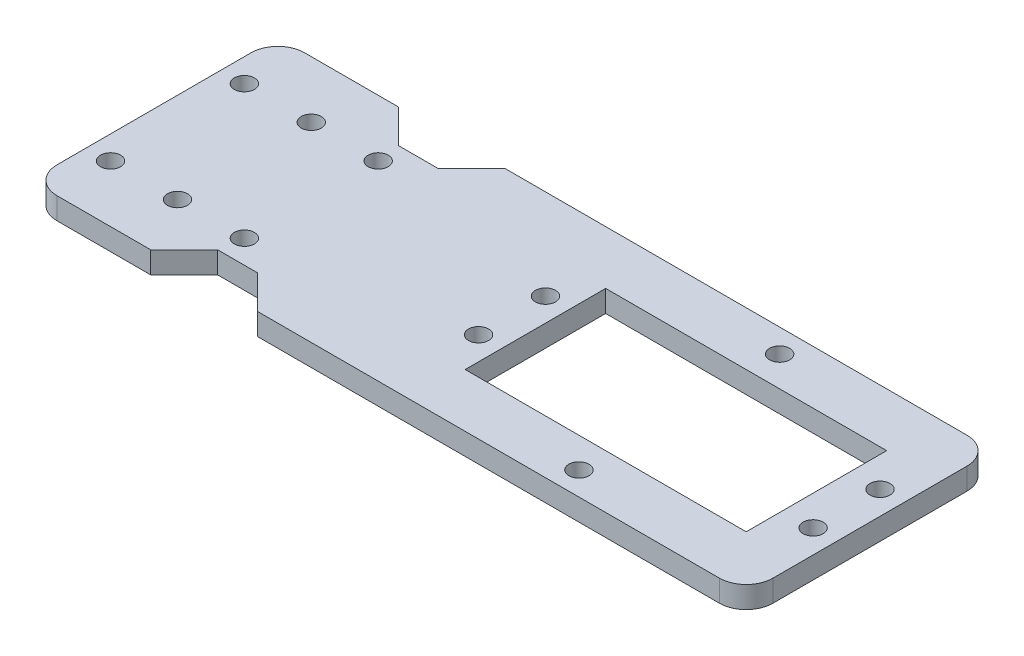
ISO-10303-21;
HEADER;
FILE_DESCRIPTION(('STEP AP214'),'2;1');
FILE_NAME('part.step','',(''),(''),'','','');
FILE_SCHEMA(('AUTOMOTIVE_DESIGN { 1 0 10303 214 1 1 1 1 }'));
ENDSEC;
DATA;
#1=APPLICATION_CONTEXT('core data for automotive mechanical design processes');
#2=APPLICATION_PROTOCOL_DEFINITION('international standard','automotive_design',2000,#1);
#3=PRODUCT_CONTEXT('',#1,'mechanical');
#4=PRODUCT('Part','Part','',(#3));
#5=PRODUCT_RELATED_PRODUCT_CATEGORY('part','',(#4));
#6=PRODUCT_DEFINITION_FORMATION('','',#4);
#7=PRODUCT_DEFINITION_CONTEXT('part definition',#1,'design');
#8=PRODUCT_DEFINITION('design','',#6,#7);
#9=PRODUCT_DEFINITION_SHAPE('','',#8);
#10=(LENGTH_UNIT() NAMED_UNIT(*) SI_UNIT(.MILLI.,.METRE.));
#11=(NAMED_UNIT(*) PLANE_ANGLE_UNIT() SI_UNIT($,.RADIAN.));
#12=(NAMED_UNIT(*) SI_UNIT($,.STERADIAN.) SOLID_ANGLE_UNIT());
#13=UNCERTAINTY_MEASURE_WITH_UNIT(LENGTH_MEASURE(1.E-05),#10,'distance_accuracy_value','');
#14=(GEOMETRIC_REPRESENTATION_CONTEXT(3) GLOBAL_UNCERTAINTY_ASSIGNED_CONTEXT((#13)) GLOBAL_UNIT_ASSIGNED_CONTEXT((#10,
#11,#12)) REPRESENTATION_CONTEXT('',''));
#15=CARTESIAN_POINT('',(0.,0.,0.));
#16=DIRECTION('',(0.,0.,1.));
#17=DIRECTION('',(1.,0.,0.));
#18=AXIS2_PLACEMENT_3D('',#15,#16,#17);
#19=CARTESIAN_POINT('',(0.,3.25,10.5000000000001));
#20=DIRECTION('',(0.,0.,-1.));
#21=DIRECTION('',(-1.,0.,0.));
#22=AXIS2_PLACEMENT_3D('',#19,#20,#21);
#23=PLANE('',#22);
#24=DIRECTION('',(1.,0.,0.));
#25=VECTOR('',#24,1.);
#26=CARTESIAN_POINT('',(0.,0.,10.5000000000001));
#27=LINE('',#26,#25);
#28=CARTESIAN_POINT('',(3.50000000000001,0.,10.5000000000001));
#29=VERTEX_POINT('',#28);
#30=CARTESIAN_POINT('',(45.5,0.,10.4999999999999));
#31=VERTEX_POINT('',#30);
#32=EDGE_CURVE('E289',#29,#31,#27,.T.);
#33=ORIENTED_EDGE('',*,*,#32,.F.);
#34=DIRECTION('',(0.,-1.,0.));
#35=VECTOR('',#34,1.);
#36=CARTESIAN_POINT('',(3.50000000000001,3.25,10.5000000000001));
#37=LINE('',#36,#35);
#38=CARTESIAN_POINT('',(3.50000000000001,3.25,10.5000000000001));
#39=VERTEX_POINT('',#38);
#40=EDGE_CURVE('E11',#39,#29,#37,.T.);
#41=ORIENTED_EDGE('',*,*,#40,.F.);
#42=DIRECTION('',(1.,0.,0.));
#43=VECTOR('',#42,1.);
#44=CARTESIAN_POINT('',(0.,3.25,10.5000000000001));
#45=LINE('',#44,#43);
#46=CARTESIAN_POINT('',(45.5,3.25,10.4999999999999));
#47=VERTEX_POINT('',#46);
#48=EDGE_CURVE('E196',#39,#47,#45,.T.);
#49=ORIENTED_EDGE('',*,*,#48,.T.);
#50=DIRECTION('',(0.,-1.,0.));
#51=VECTOR('',#50,1.);
#52=CARTESIAN_POINT('',(45.5,3.25,10.4999999999999));
#53=LINE('',#52,#51);
#54=EDGE_CURVE('E56',#47,#31,#53,.T.);
#55=ORIENTED_EDGE('',*,*,#54,.T.);
#56=EDGE_LOOP('',(#33,#41,#49,#55));
#57=FACE_BOUND('',#56,.T.);
#58=ADVANCED_FACE('F37',(#57),#23,.T.);
#59=CARTESIAN_POINT('',(3.5,3.25,0.));
#60=DIRECTION('',(1.,0.,0.));
#61=DIRECTION('',(0.,0.,-1.));
#62=AXIS2_PLACEMENT_3D('',#59,#60,#61);
#63=PLANE('',#62);
#64=DIRECTION('',(0.,0.,1.));
#65=VECTOR('',#64,1.);
#66=CARTESIAN_POINT('',(3.5,0.,0.));
#67=LINE('',#66,#65);
#68=CARTESIAN_POINT('',(3.5,0.,-10.4999999999999));
#69=VERTEX_POINT('',#68);
#70=EDGE_CURVE('E185',#69,#29,#67,.T.);
#71=ORIENTED_EDGE('',*,*,#70,.F.);
#72=DIRECTION('',(0.,-1.,0.));
#73=VECTOR('',#72,1.);
#74=CARTESIAN_POINT('',(3.5,3.25,-10.4999999999999));
#75=LINE('',#74,#73);
#76=CARTESIAN_POINT('',(3.5,3.25,-10.4999999999999));
#77=VERTEX_POINT('',#76);
#78=EDGE_CURVE('E47',#77,#69,#75,.T.);
#79=ORIENTED_EDGE('',*,*,#78,.F.);
#80=DIRECTION('',(0.,0.,1.));
#81=VECTOR('',#80,1.);
#82=CARTESIAN_POINT('',(3.5,3.25,0.));
#83=LINE('',#82,#81);
#84=EDGE_CURVE('E183',#77,#39,#83,.T.);
#85=ORIENTED_EDGE('',*,*,#84,.T.);
#86=ORIENTED_EDGE('',*,*,#40,.T.);
#87=EDGE_LOOP('',(#71,#79,#85,#86));
#88=FACE_BOUND('',#87,.T.);
#89=ADVANCED_FACE('F182',(#88),#63,.T.);
#90=CARTESIAN_POINT('',(0.,3.25,-10.4999999999999));
#91=DIRECTION('',(0.,0.,1.));
#92=DIRECTION('',(1.,0.,0.));
#93=AXIS2_PLACEMENT_3D('',#90,#91,#92);
#94=PLANE('',#93);
#95=DIRECTION('',(-1.,0.,0.));
#96=VECTOR('',#95,1.);
#97=CARTESIAN_POINT('',(0.,0.,-10.4999999999999));
#98=LINE('',#97,#96);
#99=CARTESIAN_POINT('',(45.5,0.,-10.5000000000001));
#100=VERTEX_POINT('',#99);
#101=EDGE_CURVE('E292',#100,#69,#98,.T.);
#102=ORIENTED_EDGE('',*,*,#101,.F.);
#103=DIRECTION('',(0.,-1.,0.));
#104=VECTOR('',#103,1.);
#105=CARTESIAN_POINT('',(45.5,3.25,-10.5000000000001));
#106=LINE('',#105,#104);
#107=CARTESIAN_POINT('',(45.5,3.25,-10.5000000000001));
#108=VERTEX_POINT('',#107);
#109=EDGE_CURVE('E117',#108,#100,#106,.T.);
#110=ORIENTED_EDGE('',*,*,#109,.F.);
#111=DIRECTION('',(-1.,0.,0.));
#112=VECTOR('',#111,1.);
#113=CARTESIAN_POINT('',(0.,3.25,-10.4999999999999));
#114=LINE('',#113,#112);
#115=EDGE_CURVE('E195',#108,#77,#114,.T.);
#116=ORIENTED_EDGE('',*,*,#115,.T.);
#117=ORIENTED_EDGE('',*,*,#78,.T.);
#118=EDGE_LOOP('',(#102,#110,#116,#117));
#119=FACE_BOUND('',#118,.T.);
#120=ADVANCED_FACE('F198',(#119),#94,.T.);
#121=CARTESIAN_POINT('',(49.5,3.25,-14.5));
#122=DIRECTION('',(0.,-1.,0.));
#123=DIRECTION('',(0.,0.,-1.));
#124=AXIS2_PLACEMENT_3D('',#121,#122,#123);
#125=CYLINDRICAL_SURFACE('',#124,4.);
#126=CARTESIAN_POINT('',(49.5,0.,-14.5));
#127=DIRECTION('',(0.,1.,0.));
#128=DIRECTION('',(0.,0.,1.));
#129=AXIS2_PLACEMENT_3D('',#126,#127,#128);
#130=CIRCLE('',#129,4.);
#131=CARTESIAN_POINT('',(49.5,0.,-18.5));
#132=VERTEX_POINT('',#131);
#133=CARTESIAN_POINT('',(53.5,0.,-14.5));
#134=VERTEX_POINT('',#133);
#135=EDGE_CURVE('E241',#132,#134,#130,.F.);
#136=ORIENTED_EDGE('',*,*,#135,.F.);
#137=DIRECTION('',(0.,-1.,0.));
#138=VECTOR('',#137,1.);
#139=CARTESIAN_POINT('',(49.5,3.25,-18.5));
#140=LINE('',#139,#138);
#141=CARTESIAN_POINT('',(49.5,3.25,-18.5));
#142=VERTEX_POINT('',#141);
#143=EDGE_CURVE('E41',#142,#132,#140,.T.);
#144=ORIENTED_EDGE('',*,*,#143,.F.);
#145=CARTESIAN_POINT('',(49.5,3.25,-14.5));
#146=DIRECTION('',(0.,1.,0.));
#147=DIRECTION('',(0.,0.,1.));
#148=AXIS2_PLACEMENT_3D('',#145,#146,#147);
#149=CIRCLE('',#148,4.);
#150=CARTESIAN_POINT('',(53.5,3.25,-14.5));
#151=VERTEX_POINT('',#150);
#152=EDGE_CURVE('E786',#142,#151,#149,.F.);
#153=ORIENTED_EDGE('',*,*,#152,.T.);
#154=DIRECTION('',(0.,-1.,0.));
#155=VECTOR('',#154,1.);
#156=CARTESIAN_POINT('',(53.5,3.25,-14.5));
#157=LINE('',#156,#155);
#158=EDGE_CURVE('E201',#151,#134,#157,.T.);
#159=ORIENTED_EDGE('',*,*,#158,.T.);
#160=EDGE_LOOP('',(#136,#144,#153,#159));
#161=FACE_BOUND('',#160,.T.);
#162=ADVANCED_FACE('F340',(#161),#125,.T.);
#163=CARTESIAN_POINT('',(0.,3.25,-18.5));
#164=DIRECTION('',(0.,0.,-1.));
#165=DIRECTION('',(-1.,0.,0.));
#166=AXIS2_PLACEMENT_3D('',#163,#164,#165);
#167=PLANE('',#166);
#168=DIRECTION('',(1.,0.,0.));
#169=VECTOR('',#168,1.);
#170=CARTESIAN_POINT('',(0.,0.,-18.5));
#171=LINE('',#170,#169);
#172=CARTESIAN_POINT('',(-19.5,0.,-18.5));
#173=VERTEX_POINT('',#172);
#174=EDGE_CURVE('E244',#173,#132,#171,.T.);
#175=ORIENTED_EDGE('',*,*,#174,.F.);
#176=DIRECTION('',(0.,-1.,0.));
#177=VECTOR('',#176,1.);
#178=CARTESIAN_POINT('',(-19.5,3.25,-18.5));
#179=LINE('',#178,#177);
#180=CARTESIAN_POINT('',(-19.5,3.25,-18.5));
#181=VERTEX_POINT('',#180);
#182=EDGE_CURVE('E330',#181,#173,#179,.T.);
#183=ORIENTED_EDGE('',*,*,#182,.F.);
#184=DIRECTION('',(1.,0.,0.));
#185=VECTOR('',#184,1.);
#186=CARTESIAN_POINT('',(0.,3.25,-18.5));
#187=LINE('',#186,#185);
#188=EDGE_CURVE('E339',#181,#142,#187,.T.);
#189=ORIENTED_EDGE('',*,*,#188,.T.);
#190=ORIENTED_EDGE('',*,*,#143,.T.);
#191=EDGE_LOOP('',(#175,#183,#189,#190));
#192=FACE_BOUND('',#191,.T.);
#193=ADVANCED_FACE('F337',(#192),#167,.T.);
#194=CARTESIAN_POINT('',(-19.,3.25,-19.));
#195=DIRECTION('',(-0.707106781186547,0.,-0.707106781186548));
#196=DIRECTION('',(-0.707106781186548,0.,0.707106781186547));
#197=AXIS2_PLACEMENT_3D('',#194,#195,#196);
#198=PLANE('',#197);
#199=DIRECTION('',(0.707106781186548,0.,-0.707106781186547));
#200=VECTOR('',#199,1.);
#201=CARTESIAN_POINT('',(-19.,0.,-19.));
#202=LINE('',#201,#200);
#203=CARTESIAN_POINT('',(-24.5,0.,-13.5));
#204=VERTEX_POINT('',#203);
#205=EDGE_CURVE('E247',#204,#173,#202,.T.);
#206=ORIENTED_EDGE('',*,*,#205,.F.);
#207=DIRECTION('',(0.,-1.,0.));
#208=VECTOR('',#207,1.);
#209=CARTESIAN_POINT('',(-24.5,3.25,-13.5));
#210=LINE('',#209,#208);
#211=CARTESIAN_POINT('',(-24.5,3.25,-13.5));
#212=VERTEX_POINT('',#211);
#213=EDGE_CURVE('E329',#212,#204,#210,.T.);
#214=ORIENTED_EDGE('',*,*,#213,.F.);
#215=DIRECTION('',(0.707106781186548,0.,-0.707106781186547));
#216=VECTOR('',#215,1.);
#217=CARTESIAN_POINT('',(-19.,3.25,-19.));
#218=LINE('',#217,#216);
#219=EDGE_CURVE('E348',#212,#181,#218,.T.);
#220=ORIENTED_EDGE('',*,*,#219,.T.);
#221=ORIENTED_EDGE('',*,*,#182,.T.);
#222=EDGE_LOOP('',(#206,#214,#220,#221));
#223=FACE_BOUND('',#222,.T.);
#224=ADVANCED_FACE('F346',(#223),#198,.T.);
#225=CARTESIAN_POINT('',(0.,3.25,-13.5));
#226=DIRECTION('',(0.,0.,-1.));
#227=DIRECTION('',(-1.,0.,0.));
#228=AXIS2_PLACEMENT_3D('',#225,#226,#227);
#229=PLANE('',#228);
#230=DIRECTION('',(1.,0.,0.));
#231=VECTOR('',#230,1.);
#232=CARTESIAN_POINT('',(0.,0.,-13.5));
#233=LINE('',#232,#231);
#234=CARTESIAN_POINT('',(-30.5,0.,-13.5));
#235=VERTEX_POINT('',#234);
#236=EDGE_CURVE('E250',#235,#204,#233,.T.);
#237=ORIENTED_EDGE('',*,*,#236,.F.);
#238=DIRECTION('',(0.,-1.,0.));
#239=VECTOR('',#238,1.);
#240=CARTESIAN_POINT('',(-30.5,3.25,-13.5));
#241=LINE('',#240,#239);
#242=CARTESIAN_POINT('',(-30.5,3.25,-13.5));
#243=VERTEX_POINT('',#242);
#244=EDGE_CURVE('E327',#243,#235,#241,.T.);
#245=ORIENTED_EDGE('',*,*,#244,.F.);
#246=DIRECTION('',(1.,0.,0.));
#247=VECTOR('',#246,1.);
#248=CARTESIAN_POINT('',(0.,3.25,-13.5));
#249=LINE('',#248,#247);
#250=EDGE_CURVE('E354',#243,#212,#249,.T.);
#251=ORIENTED_EDGE('',*,*,#250,.T.);
#252=ORIENTED_EDGE('',*,*,#213,.T.);
#253=EDGE_LOOP('',(#237,#245,#251,#252));
#254=FACE_BOUND('',#253,.T.);
#255=ADVANCED_FACE('F357',(#254),#229,.T.);
#256=CARTESIAN_POINT('',(-8.49999999999999,3.25,8.49999999999999));
#257=DIRECTION('',(0.707106781186547,0.,-0.707106781186548));
#258=DIRECTION('',(-0.707106781186548,0.,-0.707106781186547));
#259=AXIS2_PLACEMENT_3D('',#256,#257,#258);
#260=PLANE('',#259);
#261=DIRECTION('',(0.707106781186548,0.,0.707106781186547));
#262=VECTOR('',#261,1.);
#263=CARTESIAN_POINT('',(-8.49999999999999,0.,8.49999999999999));
#264=LINE('',#263,#262);
#265=CARTESIAN_POINT('',(-35.5,0.,-18.5));
#266=VERTEX_POINT('',#265);
#267=EDGE_CURVE('E253',#266,#235,#264,.T.);
#268=ORIENTED_EDGE('',*,*,#267,.F.);
#269=DIRECTION('',(0.,-1.,0.));
#270=VECTOR('',#269,1.);
#271=CARTESIAN_POINT('',(-35.5,3.25,-18.5));
#272=LINE('',#271,#270);
#273=CARTESIAN_POINT('',(-35.5,3.25,-18.5));
#274=VERTEX_POINT('',#273);
#275=EDGE_CURVE('E325',#274,#266,#272,.T.);
#276=ORIENTED_EDGE('',*,*,#275,.F.);
#277=DIRECTION('',(0.707106781186548,0.,0.707106781186547));
#278=VECTOR('',#277,1.);
#279=CARTESIAN_POINT('',(-8.49999999999999,3.25,8.49999999999999));
#280=LINE('',#279,#278);
#281=EDGE_CURVE('E358',#274,#243,#280,.T.);
#282=ORIENTED_EDGE('',*,*,#281,.T.);
#283=ORIENTED_EDGE('',*,*,#244,.T.);
#284=EDGE_LOOP('',(#268,#276,#282,#283));
#285=FACE_BOUND('',#284,.T.);
#286=ADVANCED_FACE('F457',(#285),#260,.T.);
#287=CARTESIAN_POINT('',(0.,3.25,-18.5));
#288=DIRECTION('',(0.,0.,-1.));
#289=DIRECTION('',(-1.,0.,0.));
#290=AXIS2_PLACEMENT_3D('',#287,#288,#289);
#291=PLANE('',#290);
#292=DIRECTION('',(1.,0.,0.));
#293=VECTOR('',#292,1.);
#294=CARTESIAN_POINT('',(0.,0.,-18.5));
#295=LINE('',#294,#293);
#296=CARTESIAN_POINT('',(-49.5,0.,-18.5));
#297=VERTEX_POINT('',#296);
#298=EDGE_CURVE('E256',#297,#266,#295,.T.);
#299=ORIENTED_EDGE('',*,*,#298,.F.);
#300=DIRECTION('',(0.,-1.,0.));
#301=VECTOR('',#300,1.);
#302=CARTESIAN_POINT('',(-49.5,3.25,-18.5));
#303=LINE('',#302,#301);
#304=CARTESIAN_POINT('',(-49.5,3.25,-18.5));
#305=VERTEX_POINT('',#304);
#306=EDGE_CURVE('E323',#305,#297,#303,.T.);
#307=ORIENTED_EDGE('',*,*,#306,.F.);
#308=DIRECTION('',(1.,0.,0.));
#309=VECTOR('',#308,1.);
#310=CARTESIAN_POINT('',(0.,3.25,-18.5));
#311=LINE('',#310,#309);
#312=EDGE_CURVE('E360',#305,#274,#311,.T.);
#313=ORIENTED_EDGE('',*,*,#312,.T.);
#314=ORIENTED_EDGE('',*,*,#275,.T.);
#315=EDGE_LOOP('',(#299,#307,#313,#314));
#316=FACE_BOUND('',#315,.T.);
#317=ADVANCED_FACE('F453',(#316),#291,.T.);
#318=CARTESIAN_POINT('',(-49.5,3.25,-14.5));
#319=DIRECTION('',(0.,-1.,0.));
#320=DIRECTION('',(0.,0.,-1.));
#321=AXIS2_PLACEMENT_3D('',#318,#319,#320);
#322=CYLINDRICAL_SURFACE('',#321,4.);
#323=CARTESIAN_POINT('',(-49.5,0.,-14.5));
#324=DIRECTION('',(0.,1.,0.));
#325=DIRECTION('',(0.,0.,1.));
#326=AXIS2_PLACEMENT_3D('',#323,#324,#325);
#327=CIRCLE('',#326,4.);
#328=CARTESIAN_POINT('',(-53.5,0.,-14.5));
#329=VERTEX_POINT('',#328);
#330=EDGE_CURVE('E259',#297,#329,#327,.T.);
#331=ORIENTED_EDGE('',*,*,#330,.T.);
#332=DIRECTION('',(0.,-1.,0.));
#333=VECTOR('',#332,1.);
#334=CARTESIAN_POINT('',(-53.5,3.25,-14.5));
#335=LINE('',#334,#333);
#336=CARTESIAN_POINT('',(-53.5,3.25,-14.5));
#337=VERTEX_POINT('',#336);
#338=EDGE_CURVE('E320',#337,#329,#335,.T.);
#339=ORIENTED_EDGE('',*,*,#338,.F.);
#340=CARTESIAN_POINT('',(-49.5,3.25,-14.5));
#341=DIRECTION('',(0.,1.,0.));
#342=DIRECTION('',(0.,0.,1.));
#343=AXIS2_PLACEMENT_3D('',#340,#341,#342);
#344=CIRCLE('',#343,4.);
#345=EDGE_CURVE('E366',#305,#337,#344,.T.);
#346=ORIENTED_EDGE('',*,*,#345,.F.);
#347=ORIENTED_EDGE('',*,*,#306,.T.);
#348=EDGE_LOOP('',(#331,#339,#346,#347));
#349=FACE_BOUND('',#348,.T.);
#350=ADVANCED_FACE('F449',(#349),#322,.T.);
#351=CARTESIAN_POINT('',(-53.5,3.25,0.));
#352=DIRECTION('',(1.,0.,0.));
#353=DIRECTION('',(0.,0.,-1.));
#354=AXIS2_PLACEMENT_3D('',#351,#352,#353);
#355=PLANE('',#354);
#356=DIRECTION('',(0.,0.,1.));
#357=VECTOR('',#356,1.);
#358=CARTESIAN_POINT('',(-53.5,0.,0.));
#359=LINE('',#358,#357);
#360=CARTESIAN_POINT('',(-53.5,0.,14.5));
#361=VERTEX_POINT('',#360);
#362=EDGE_CURVE('E262',#329,#361,#359,.T.);
#363=ORIENTED_EDGE('',*,*,#362,.T.);
#364=DIRECTION('',(0.,-1.,0.));
#365=VECTOR('',#364,1.);
#366=CARTESIAN_POINT('',(-53.5,3.25,14.5));
#367=LINE('',#366,#365);
#368=CARTESIAN_POINT('',(-53.5,3.25,14.5));
#369=VERTEX_POINT('',#368);
#370=EDGE_CURVE('E317',#369,#361,#367,.T.);
#371=ORIENTED_EDGE('',*,*,#370,.F.);
#372=DIRECTION('',(0.,0.,1.));
#373=VECTOR('',#372,1.);
#374=CARTESIAN_POINT('',(-53.5,3.25,0.));
#375=LINE('',#374,#373);
#376=EDGE_CURVE('E369',#337,#369,#375,.T.);
#377=ORIENTED_EDGE('',*,*,#376,.F.);
#378=ORIENTED_EDGE('',*,*,#338,.T.);
#379=EDGE_LOOP('',(#363,#371,#377,#378));
#380=FACE_BOUND('',#379,.T.);
#381=ADVANCED_FACE('F445',(#380),#355,.F.);
#382=CARTESIAN_POINT('',(-49.5,3.25,14.5));
#383=DIRECTION('',(0.,-1.,0.));
#384=DIRECTION('',(0.,0.,-1.));
#385=AXIS2_PLACEMENT_3D('',#382,#383,#384);
#386=CYLINDRICAL_SURFACE('',#385,4.);
#387=CARTESIAN_POINT('',(-49.5,0.,14.5));
#388=DIRECTION('',(0.,1.,0.));
#389=DIRECTION('',(0.,0.,1.));
#390=AXIS2_PLACEMENT_3D('',#387,#388,#389);
#391=CIRCLE('',#390,4.);
#392=CARTESIAN_POINT('',(-49.5,0.,18.5));
#393=VERTEX_POINT('',#392);
#394=EDGE_CURVE('E265',#361,#393,#391,.T.);
#395=ORIENTED_EDGE('',*,*,#394,.T.);
#396=DIRECTION('',(0.,-1.,0.));
#397=VECTOR('',#396,1.);
#398=CARTESIAN_POINT('',(-49.5,3.25,18.5));
#399=LINE('',#398,#397);
#400=CARTESIAN_POINT('',(-49.5,3.25,18.5));
#401=VERTEX_POINT('',#400);
#402=EDGE_CURVE('E314',#401,#393,#399,.T.);
#403=ORIENTED_EDGE('',*,*,#402,.F.);
#404=CARTESIAN_POINT('',(-49.5,3.25,14.5));
#405=DIRECTION('',(0.,1.,0.));
#406=DIRECTION('',(0.,0.,1.));
#407=AXIS2_PLACEMENT_3D('',#404,#405,#406);
#408=CIRCLE('',#407,4.);
#409=EDGE_CURVE('E372',#369,#401,#408,.T.);
#410=ORIENTED_EDGE('',*,*,#409,.F.);
#411=ORIENTED_EDGE('',*,*,#370,.T.);
#412=EDGE_LOOP('',(#395,#403,#410,#411));
#413=FACE_BOUND('',#412,.T.);
#414=ADVANCED_FACE('F441',(#413),#386,.T.);
#415=CARTESIAN_POINT('',(0.,3.25,18.5));
#416=DIRECTION('',(0.,0.,-1.));
#417=DIRECTION('',(-1.,0.,0.));
#418=AXIS2_PLACEMENT_3D('',#415,#416,#417);
#419=PLANE('',#418);
#420=DIRECTION('',(1.,0.,0.));
#421=VECTOR('',#420,1.);
#422=CARTESIAN_POINT('',(0.,0.,18.5));
#423=LINE('',#422,#421);
#424=CARTESIAN_POINT('',(-35.5,0.,18.5));
#425=VERTEX_POINT('',#424);
#426=EDGE_CURVE('E268',#393,#425,#423,.T.);
#427=ORIENTED_EDGE('',*,*,#426,.T.);
#428=DIRECTION('',(0.,-1.,0.));
#429=VECTOR('',#428,1.);
#430=CARTESIAN_POINT('',(-35.5,3.25,18.5));
#431=LINE('',#430,#429);
#432=CARTESIAN_POINT('',(-35.5,3.25,18.5));
#433=VERTEX_POINT('',#432);
#434=EDGE_CURVE('E312',#433,#425,#431,.T.);
#435=ORIENTED_EDGE('',*,*,#434,.F.);
#436=DIRECTION('',(1.,0.,0.));
#437=VECTOR('',#436,1.);
#438=CARTESIAN_POINT('',(0.,3.25,18.5));
#439=LINE('',#438,#437);
#440=EDGE_CURVE('E375',#401,#433,#439,.T.);
#441=ORIENTED_EDGE('',*,*,#440,.F.);
#442=ORIENTED_EDGE('',*,*,#402,.T.);
#443=EDGE_LOOP('',(#427,#435,#441,#442));
#444=FACE_BOUND('',#443,.T.);
#445=ADVANCED_FACE('F437',(#444),#419,.F.);
#446=CARTESIAN_POINT('',(-8.49999999999996,3.25,-8.49999999999998));
#447=DIRECTION('',(0.707106781186547,0.,0.707106781186548));
#448=DIRECTION('',(0.707106781186548,0.,-0.707106781186547));
#449=AXIS2_PLACEMENT_3D('',#446,#447,#448);
#450=PLANE('',#449);
#451=DIRECTION('',(-0.707106781186548,0.,0.707106781186547));
#452=VECTOR('',#451,1.);
#453=CARTESIAN_POINT('',(-8.49999999999996,0.,-8.49999999999998));
#454=LINE('',#453,#452);
#455=CARTESIAN_POINT('',(-30.5,0.,13.5));
#456=VERTEX_POINT('',#455);
#457=EDGE_CURVE('E271',#456,#425,#454,.T.);
#458=ORIENTED_EDGE('',*,*,#457,.F.);
#459=DIRECTION('',(0.,-1.,0.));
#460=VECTOR('',#459,1.);
#461=CARTESIAN_POINT('',(-30.5,3.25,13.5));
#462=LINE('',#461,#460);
#463=CARTESIAN_POINT('',(-30.5,3.25,13.5));
#464=VERTEX_POINT('',#463);
#465=EDGE_CURVE('E310',#464,#456,#462,.T.);
#466=ORIENTED_EDGE('',*,*,#465,.F.);
#467=DIRECTION('',(-0.707106781186548,0.,0.707106781186547));
#468=VECTOR('',#467,1.);
#469=CARTESIAN_POINT('',(-8.49999999999996,3.25,-8.49999999999998));
#470=LINE('',#469,#468);
#471=EDGE_CURVE('E377',#464,#433,#470,.T.);
#472=ORIENTED_EDGE('',*,*,#471,.T.);
#473=ORIENTED_EDGE('',*,*,#434,.T.);
#474=EDGE_LOOP('',(#458,#466,#472,#473));
#475=FACE_BOUND('',#474,.T.);
#476=ADVANCED_FACE('F433',(#475),#450,.T.);
#477=CARTESIAN_POINT('',(0.,3.25,13.5));
#478=DIRECTION('',(0.,0.,1.));
#479=DIRECTION('',(1.,0.,0.));
#480=AXIS2_PLACEMENT_3D('',#477,#478,#479);
#481=PLANE('',#480);
#482=DIRECTION('',(-1.,0.,0.));
#483=VECTOR('',#482,1.);
#484=CARTESIAN_POINT('',(0.,0.,13.5));
#485=LINE('',#484,#483);
#486=CARTESIAN_POINT('',(-24.5,0.,13.5));
#487=VERTEX_POINT('',#486);
#488=EDGE_CURVE('E274',#487,#456,#485,.T.);
#489=ORIENTED_EDGE('',*,*,#488,.F.);
#490=DIRECTION('',(0.,-1.,0.));
#491=VECTOR('',#490,1.);
#492=CARTESIAN_POINT('',(-24.5,3.25,13.5));
#493=LINE('',#492,#491);
#494=CARTESIAN_POINT('',(-24.5,3.25,13.5));
#495=VERTEX_POINT('',#494);
#496=EDGE_CURVE('E308',#495,#487,#493,.T.);
#497=ORIENTED_EDGE('',*,*,#496,.F.);
#498=DIRECTION('',(-1.,0.,0.));
#499=VECTOR('',#498,1.);
#500=CARTESIAN_POINT('',(0.,3.25,13.5));
#501=LINE('',#500,#499);
#502=EDGE_CURVE('E380',#495,#464,#501,.T.);
#503=ORIENTED_EDGE('',*,*,#502,.T.);
#504=ORIENTED_EDGE('',*,*,#465,.T.);
#505=EDGE_LOOP('',(#489,#497,#503,#504));
#506=FACE_BOUND('',#505,.T.);
#507=ADVANCED_FACE('F429',(#506),#481,.T.);
#508=CARTESIAN_POINT('',(-19.,3.25,19.));
#509=DIRECTION('',(-0.707106781186547,0.,0.707106781186548));
#510=DIRECTION('',(0.707106781186548,0.,0.707106781186547));
#511=AXIS2_PLACEMENT_3D('',#508,#509,#510);
#512=PLANE('',#511);
#513=DIRECTION('',(-0.707106781186548,0.,-0.707106781186547));
#514=VECTOR('',#513,1.);
#515=CARTESIAN_POINT('',(-19.,0.,19.));
#516=LINE('',#515,#514);
#517=CARTESIAN_POINT('',(-19.5,0.,18.5));
#518=VERTEX_POINT('',#517);
#519=EDGE_CURVE('E277',#518,#487,#516,.T.);
#520=ORIENTED_EDGE('',*,*,#519,.F.);
#521=DIRECTION('',(0.,-1.,0.));
#522=VECTOR('',#521,1.);
#523=CARTESIAN_POINT('',(-19.5,3.25,18.5));
#524=LINE('',#523,#522);
#525=CARTESIAN_POINT('',(-19.5,3.25,18.5));
#526=VERTEX_POINT('',#525);
#527=EDGE_CURVE('E306',#526,#518,#524,.T.);
#528=ORIENTED_EDGE('',*,*,#527,.F.);
#529=DIRECTION('',(-0.707106781186548,0.,-0.707106781186547));
#530=VECTOR('',#529,1.);
#531=CARTESIAN_POINT('',(-19.,3.25,19.));
#532=LINE('',#531,#530);
#533=EDGE_CURVE('E383',#526,#495,#532,.T.);
#534=ORIENTED_EDGE('',*,*,#533,.T.);
#535=ORIENTED_EDGE('',*,*,#496,.T.);
#536=EDGE_LOOP('',(#520,#528,#534,#535));
#537=FACE_BOUND('',#536,.T.);
#538=ADVANCED_FACE('F425',(#537),#512,.T.);
#539=CARTESIAN_POINT('',(0.,3.25,18.5));
#540=DIRECTION('',(0.,0.,-1.));
#541=DIRECTION('',(-1.,0.,0.));
#542=AXIS2_PLACEMENT_3D('',#539,#540,#541);
#543=PLANE('',#542);
#544=DIRECTION('',(1.,0.,0.));
#545=VECTOR('',#544,1.);
#546=CARTESIAN_POINT('',(0.,0.,18.5));
#547=LINE('',#546,#545);
#548=CARTESIAN_POINT('',(49.5,0.,18.5));
#549=VERTEX_POINT('',#548);
#550=EDGE_CURVE('E280',#518,#549,#547,.T.);
#551=ORIENTED_EDGE('',*,*,#550,.T.);
#552=DIRECTION('',(0.,-1.,0.));
#553=VECTOR('',#552,1.);
#554=CARTESIAN_POINT('',(49.5,3.25,18.5));
#555=LINE('',#554,#553);
#556=CARTESIAN_POINT('',(49.5,3.25,18.5));
#557=VERTEX_POINT('',#556);
#558=EDGE_CURVE('E303',#557,#549,#555,.T.);
#559=ORIENTED_EDGE('',*,*,#558,.F.);
#560=DIRECTION('',(1.,0.,0.));
#561=VECTOR('',#560,1.);
#562=CARTESIAN_POINT('',(0.,3.25,18.5));
#563=LINE('',#562,#561);
#564=EDGE_CURVE('E386',#526,#557,#563,.T.);
#565=ORIENTED_EDGE('',*,*,#564,.F.);
#566=ORIENTED_EDGE('',*,*,#527,.T.);
#567=EDGE_LOOP('',(#551,#559,#565,#566));
#568=FACE_BOUND('',#567,.T.);
#569=ADVANCED_FACE('F421',(#568),#543,.F.);
#570=CARTESIAN_POINT('',(49.5,3.25,14.5));
#571=DIRECTION('',(0.,-1.,0.));
#572=DIRECTION('',(0.,0.,-1.));
#573=AXIS2_PLACEMENT_3D('',#570,#571,#572);
#574=CYLINDRICAL_SURFACE('',#573,4.);
#575=CARTESIAN_POINT('',(49.5,0.,14.5));
#576=DIRECTION('',(0.,1.,0.));
#577=DIRECTION('',(0.,0.,1.));
#578=AXIS2_PLACEMENT_3D('',#575,#576,#577);
#579=CIRCLE('',#578,4.);
#580=CARTESIAN_POINT('',(53.5,0.,14.5));
#581=VERTEX_POINT('',#580);
#582=EDGE_CURVE('E283',#549,#581,#579,.T.);
#583=ORIENTED_EDGE('',*,*,#582,.T.);
#584=DIRECTION('',(0.,-1.,0.));
#585=VECTOR('',#584,1.);
#586=CARTESIAN_POINT('',(53.5,3.25,14.5));
#587=LINE('',#586,#585);
#588=CARTESIAN_POINT('',(53.5,3.25,14.5));
#589=VERTEX_POINT('',#588);
#590=EDGE_CURVE('E301',#589,#581,#587,.T.);
#591=ORIENTED_EDGE('',*,*,#590,.F.);
#592=CARTESIAN_POINT('',(49.5,3.25,14.5));
#593=DIRECTION('',(0.,1.,0.));
#594=DIRECTION('',(0.,0.,1.));
#595=AXIS2_PLACEMENT_3D('',#592,#593,#594);
#596=CIRCLE('',#595,4.);
#597=EDGE_CURVE('E389',#557,#589,#596,.T.);
#598=ORIENTED_EDGE('',*,*,#597,.F.);
#599=ORIENTED_EDGE('',*,*,#558,.T.);
#600=EDGE_LOOP('',(#583,#591,#598,#599));
#601=FACE_BOUND('',#600,.T.);
#602=ADVANCED_FACE('F417',(#601),#574,.T.);
#603=CARTESIAN_POINT('',(53.5,3.25,0.));
#604=DIRECTION('',(1.,0.,0.));
#605=DIRECTION('',(0.,0.,-1.));
#606=AXIS2_PLACEMENT_3D('',#603,#604,#605);
#607=PLANE('',#606);
#608=DIRECTION('',(0.,0.,1.));
#609=VECTOR('',#608,1.);
#610=CARTESIAN_POINT('',(53.5,0.,0.));
#611=LINE('',#610,#609);
#612=EDGE_CURVE('E286',#134,#581,#611,.T.);
#613=ORIENTED_EDGE('',*,*,#612,.F.);
#614=ORIENTED_EDGE('',*,*,#158,.F.);
#615=DIRECTION('',(0.,0.,1.));
#616=VECTOR('',#615,1.);
#617=CARTESIAN_POINT('',(53.5,3.25,0.));
#618=LINE('',#617,#616);
#619=EDGE_CURVE('E391',#151,#589,#618,.T.);
#620=ORIENTED_EDGE('',*,*,#619,.T.);
#621=ORIENTED_EDGE('',*,*,#590,.T.);
#622=EDGE_LOOP('',(#613,#614,#620,#621));
#623=FACE_BOUND('',#622,.T.);
#624=ADVANCED_FACE('F413',(#623),#607,.T.);
#625=CARTESIAN_POINT('',(25.,3.25,15.));
#626=DIRECTION('',(0.,-1.,0.));
#627=DIRECTION('',(0.,0.,-1.));
#628=AXIS2_PLACEMENT_3D('',#625,#626,#627);
#629=CYLINDRICAL_SURFACE('',#628,1.5025);
#630=CARTESIAN_POINT('',(25.,3.25,15.));
#631=DIRECTION('',(0.,1.,0.));
#632=DIRECTION('',(0.,0.,1.));
#633=AXIS2_PLACEMENT_3D('',#630,#631,#632);
#634=CIRCLE('',#633,1.5025);
#635=CARTESIAN_POINT('',(25.,3.25,16.5025));
#636=VERTEX_POINT('',#635);
#637=EDGE_CURVE('E783',#636,#636,#634,.T.);
#638=ORIENTED_EDGE('',*,*,#637,.T.);
#639=EDGE_LOOP('',(#638));
#640=FACE_BOUND('',#639,.T.);
#641=CARTESIAN_POINT('',(25.,0.,15.));
#642=DIRECTION('',(0.,1.,0.));
#643=DIRECTION('',(0.,0.,1.));
#644=AXIS2_PLACEMENT_3D('',#641,#642,#643);
#645=CIRCLE('',#644,1.5025);
#646=CARTESIAN_POINT('',(25.,0.,16.5025));
#647=VERTEX_POINT('',#646);
#648=EDGE_CURVE('E238',#647,#647,#645,.T.);
#649=ORIENTED_EDGE('',*,*,#648,.F.);
#650=EDGE_LOOP('',(#649));
#651=FACE_BOUND('',#650,.T.);
#652=ADVANCED_FACE('F416',(#640,#651),#629,.F.);
#653=CARTESIAN_POINT('',(-40.,3.25,10.));
#654=DIRECTION('',(0.,-1.,0.));
#655=DIRECTION('',(0.,0.,-1.));
#656=AXIS2_PLACEMENT_3D('',#653,#654,#655);
#657=CYLINDRICAL_SURFACE('',#656,1.5025);
#658=CARTESIAN_POINT('',(-40.,3.25,10.));
#659=DIRECTION('',(0.,1.,0.));
#660=DIRECTION('',(0.,0.,1.));
#661=AXIS2_PLACEMENT_3D('',#658,#659,#660);
#662=CIRCLE('',#661,1.5025);
#663=CARTESIAN_POINT('',(-40.,3.25,11.5025));
#664=VERTEX_POINT('',#663);
#665=EDGE_CURVE('E780',#664,#664,#662,.T.);
#666=ORIENTED_EDGE('',*,*,#665,.T.);
#667=EDGE_LOOP('',(#666));
#668=FACE_BOUND('',#667,.T.);
#669=CARTESIAN_POINT('',(-40.,0.,10.));
#670=DIRECTION('',(0.,1.,0.));
#671=DIRECTION('',(0.,0.,1.));
#672=AXIS2_PLACEMENT_3D('',#669,#670,#671);
#673=CIRCLE('',#672,1.5025);
#674=CARTESIAN_POINT('',(-40.,0.,11.5025));
#675=VERTEX_POINT('',#674);
#676=EDGE_CURVE('E235',#675,#675,#673,.T.);
#677=ORIENTED_EDGE('',*,*,#676,.F.);
#678=EDGE_LOOP('',(#677));
#679=FACE_BOUND('',#678,.T.);
#680=ADVANCED_FACE('F472',(#668,#679),#657,.F.);
#681=CARTESIAN_POINT('',(-30.,3.25,10.));
#682=DIRECTION('',(0.,-1.,0.));
#683=DIRECTION('',(0.,0.,-1.));
#684=AXIS2_PLACEMENT_3D('',#681,#682,#683);
#685=CYLINDRICAL_SURFACE('',#684,1.5025);
#686=CARTESIAN_POINT('',(-30.,3.25,10.));
#687=DIRECTION('',(0.,1.,0.));
#688=DIRECTION('',(0.,0.,1.));
#689=AXIS2_PLACEMENT_3D('',#686,#687,#688);
#690=CIRCLE('',#689,1.5025);
#691=CARTESIAN_POINT('',(-30.,3.25,11.5025));
#692=VERTEX_POINT('',#691);
#693=EDGE_CURVE('E777',#692,#692,#690,.T.);
#694=ORIENTED_EDGE('',*,*,#693,.T.);
#695=EDGE_LOOP('',(#694));
#696=FACE_BOUND('',#695,.T.);
#697=CARTESIAN_POINT('',(-30.,0.,10.));
#698=DIRECTION('',(0.,1.,0.));
#699=DIRECTION('',(0.,0.,1.));
#700=AXIS2_PLACEMENT_3D('',#697,#698,#699);
#701=CIRCLE('',#700,1.5025);
#702=CARTESIAN_POINT('',(-30.,0.,11.5025));
#703=VERTEX_POINT('',#702);
#704=EDGE_CURVE('E232',#703,#703,#701,.T.);
#705=ORIENTED_EDGE('',*,*,#704,.F.);
#706=EDGE_LOOP('',(#705));
#707=FACE_BOUND('',#706,.T.);
#708=ADVANCED_FACE('F476',(#696,#707),#685,.F.);
#709=CARTESIAN_POINT('',(0.,3.25,5.00000000000001));
#710=DIRECTION('',(0.,-1.,0.));
#711=DIRECTION('',(0.,0.,-1.));
#712=AXIS2_PLACEMENT_3D('',#709,#710,#711);
#713=CYLINDRICAL_SURFACE('',#712,1.5025);
#714=CARTESIAN_POINT('',(0.,3.25,5.00000000000001));
#715=DIRECTION('',(0.,1.,0.));
#716=DIRECTION('',(0.,0.,1.));
#717=AXIS2_PLACEMENT_3D('',#714,#715,#716);
#718=CIRCLE('',#717,1.5025);
#719=CARTESIAN_POINT('',(0.,3.25,6.50250000000001));
#720=VERTEX_POINT('',#719);
#721=EDGE_CURVE('E774',#720,#720,#718,.T.);
#722=ORIENTED_EDGE('',*,*,#721,.T.);
#723=EDGE_LOOP('',(#722));
#724=FACE_BOUND('',#723,.T.);
#725=CARTESIAN_POINT('',(0.,0.,5.00000000000001));
#726=DIRECTION('',(0.,1.,0.));
#727=DIRECTION('',(0.,0.,1.));
#728=AXIS2_PLACEMENT_3D('',#725,#726,#727);
#729=CIRCLE('',#728,1.5025);
#730=CARTESIAN_POINT('',(0.,0.,6.50250000000001));
#731=VERTEX_POINT('',#730);
#732=EDGE_CURVE('E229',#731,#731,#729,.T.);
#733=ORIENTED_EDGE('',*,*,#732,.F.);
#734=EDGE_LOOP('',(#733));
#735=FACE_BOUND('',#734,.T.);
#736=ADVANCED_FACE('F480',(#724,#735),#713,.F.);
#737=CARTESIAN_POINT('',(50.,3.25,5.00000000000001));
#738=DIRECTION('',(0.,-1.,0.));
#739=DIRECTION('',(0.,0.,-1.));
#740=AXIS2_PLACEMENT_3D('',#737,#738,#739);
#741=CYLINDRICAL_SURFACE('',#740,1.5025);
#742=CARTESIAN_POINT('',(50.,3.25,5.00000000000001));
#743=DIRECTION('',(0.,1.,0.));
#744=DIRECTION('',(0.,0.,1.));
#745=AXIS2_PLACEMENT_3D('',#742,#743,#744);
#746=CIRCLE('',#745,1.5025);
#747=CARTESIAN_POINT('',(50.,3.25,6.50250000000001));
#748=VERTEX_POINT('',#747);
#749=EDGE_CURVE('E771',#748,#748,#746,.T.);
#750=ORIENTED_EDGE('',*,*,#749,.T.);
#751=EDGE_LOOP('',(#750));
#752=FACE_BOUND('',#751,.T.);
#753=CARTESIAN_POINT('',(50.,0.,5.00000000000001));
#754=DIRECTION('',(0.,1.,0.));
#755=DIRECTION('',(0.,0.,1.));
#756=AXIS2_PLACEMENT_3D('',#753,#754,#755);
#757=CIRCLE('',#756,1.5025);
#758=CARTESIAN_POINT('',(50.,0.,6.50250000000001));
#759=VERTEX_POINT('',#758);
#760=EDGE_CURVE('E226',#759,#759,#757,.T.);
#761=ORIENTED_EDGE('',*,*,#760,.F.);
#762=EDGE_LOOP('',(#761));
#763=FACE_BOUND('',#762,.T.);
#764=ADVANCED_FACE('F484',(#752,#763),#741,.F.);
#765=CARTESIAN_POINT('',(0.,3.25,-4.99999999999999));
#766=DIRECTION('',(0.,-1.,0.));
#767=DIRECTION('',(0.,0.,-1.));
#768=AXIS2_PLACEMENT_3D('',#765,#766,#767);
#769=CYLINDRICAL_SURFACE('',#768,1.5025);
#770=CARTESIAN_POINT('',(0.,3.25,-4.99999999999999));
#771=DIRECTION('',(0.,1.,0.));
#772=DIRECTION('',(0.,0.,1.));
#773=AXIS2_PLACEMENT_3D('',#770,#771,#772);
#774=CIRCLE('',#773,1.5025);
#775=CARTESIAN_POINT('',(0.,3.25,-3.49749999999999));
#776=VERTEX_POINT('',#775);
#777=EDGE_CURVE('E768',#776,#776,#774,.T.);
#778=ORIENTED_EDGE('',*,*,#777,.T.);
#779=EDGE_LOOP('',(#778));
#780=FACE_BOUND('',#779,.T.);
#781=CARTESIAN_POINT('',(0.,0.,-4.99999999999999));
#782=DIRECTION('',(0.,1.,0.));
#783=DIRECTION('',(0.,0.,1.));
#784=AXIS2_PLACEMENT_3D('',#781,#782,#783);
#785=CIRCLE('',#784,1.5025);
#786=CARTESIAN_POINT('',(0.,0.,-3.49749999999999));
#787=VERTEX_POINT('',#786);
#788=EDGE_CURVE('E223',#787,#787,#785,.T.);
#789=ORIENTED_EDGE('',*,*,#788,.F.);
#790=EDGE_LOOP('',(#789));
#791=FACE_BOUND('',#790,.T.);
#792=ADVANCED_FACE('F488',(#780,#791),#769,.F.);
#793=CARTESIAN_POINT('',(50.,3.25,-4.99999999999999));
#794=DIRECTION('',(0.,-1.,0.));
#795=DIRECTION('',(0.,0.,-1.));
#796=AXIS2_PLACEMENT_3D('',#793,#794,#795);
#797=CYLINDRICAL_SURFACE('',#796,1.5025);
#798=CARTESIAN_POINT('',(50.,3.25,-4.99999999999999));
#799=DIRECTION('',(0.,1.,0.));
#800=DIRECTION('',(0.,0.,1.));
#801=AXIS2_PLACEMENT_3D('',#798,#799,#800);
#802=CIRCLE('',#801,1.5025);
#803=CARTESIAN_POINT('',(50.,3.25,-3.49749999999999));
#804=VERTEX_POINT('',#803);
#805=EDGE_CURVE('E765',#804,#804,#802,.T.);
#806=ORIENTED_EDGE('',*,*,#805,.T.);
#807=EDGE_LOOP('',(#806));
#808=FACE_BOUND('',#807,.T.);
#809=CARTESIAN_POINT('',(50.,0.,-4.99999999999999));
#810=DIRECTION('',(0.,1.,0.));
#811=DIRECTION('',(0.,0.,1.));
#812=AXIS2_PLACEMENT_3D('',#809,#810,#811);
#813=CIRCLE('',#812,1.5025);
#814=CARTESIAN_POINT('',(50.,0.,-3.49749999999999));
#815=VERTEX_POINT('',#814);
#816=EDGE_CURVE('E220',#815,#815,#813,.T.);
#817=ORIENTED_EDGE('',*,*,#816,.F.);
#818=EDGE_LOOP('',(#817));
#819=FACE_BOUND('',#818,.T.);
#820=ADVANCED_FACE('F492',(#808,#819),#797,.F.);
#821=CARTESIAN_POINT('',(-40.0000000000001,3.25,-9.99999999999999));
#822=DIRECTION('',(0.,-1.,0.));
#823=DIRECTION('',(0.,0.,-1.));
#824=AXIS2_PLACEMENT_3D('',#821,#822,#823);
#825=CYLINDRICAL_SURFACE('',#824,1.5025);
#826=CARTESIAN_POINT('',(-40.0000000000001,3.25,-9.99999999999999));
#827=DIRECTION('',(0.,1.,0.));
#828=DIRECTION('',(0.,0.,1.));
#829=AXIS2_PLACEMENT_3D('',#826,#827,#828);
#830=CIRCLE('',#829,1.5025);
#831=CARTESIAN_POINT('',(-40.0000000000001,3.25,-8.4975));
#832=VERTEX_POINT('',#831);
#833=EDGE_CURVE('E762',#832,#832,#830,.T.);
#834=ORIENTED_EDGE('',*,*,#833,.T.);
#835=EDGE_LOOP('',(#834));
#836=FACE_BOUND('',#835,.T.);
#837=CARTESIAN_POINT('',(-40.0000000000001,0.,-9.99999999999999));
#838=DIRECTION('',(0.,1.,0.));
#839=DIRECTION('',(0.,0.,1.));
#840=AXIS2_PLACEMENT_3D('',#837,#838,#839);
#841=CIRCLE('',#840,1.5025);
#842=CARTESIAN_POINT('',(-40.0000000000001,0.,-8.4975));
#843=VERTEX_POINT('',#842);
#844=EDGE_CURVE('E217',#843,#843,#841,.T.);
#845=ORIENTED_EDGE('',*,*,#844,.F.);
#846=EDGE_LOOP('',(#845));
#847=FACE_BOUND('',#846,.T.);
#848=ADVANCED_FACE('F496',(#836,#847),#825,.F.);
#849=CARTESIAN_POINT('',(-30.0000000000001,3.25,-9.99999999999999));
#850=DIRECTION('',(0.,-1.,0.));
#851=DIRECTION('',(0.,0.,-1.));
#852=AXIS2_PLACEMENT_3D('',#849,#850,#851);
#853=CYLINDRICAL_SURFACE('',#852,1.5025);
#854=CARTESIAN_POINT('',(-30.0000000000001,3.25,-9.99999999999999));
#855=DIRECTION('',(0.,1.,0.));
#856=DIRECTION('',(0.,0.,1.));
#857=AXIS2_PLACEMENT_3D('',#854,#855,#856);
#858=CIRCLE('',#857,1.5025);
#859=CARTESIAN_POINT('',(-30.0000000000001,3.25,-8.4975));
#860=VERTEX_POINT('',#859);
#861=EDGE_CURVE('E755',#860,#860,#858,.T.);
#862=ORIENTED_EDGE('',*,*,#861,.T.);
#863=EDGE_LOOP('',(#862));
#864=FACE_BOUND('',#863,.T.);
#865=CARTESIAN_POINT('',(-30.0000000000001,0.,-9.99999999999999));
#866=DIRECTION('',(0.,1.,0.));
#867=DIRECTION('',(0.,0.,1.));
#868=AXIS2_PLACEMENT_3D('',#865,#866,#867);
#869=CIRCLE('',#868,1.5025);
#870=CARTESIAN_POINT('',(-30.0000000000001,0.,-8.4975));
#871=VERTEX_POINT('',#870);
#872=EDGE_CURVE('E214',#871,#871,#869,.T.);
#873=ORIENTED_EDGE('',*,*,#872,.F.);
#874=EDGE_LOOP('',(#873));
#875=FACE_BOUND('',#874,.T.);
#876=ADVANCED_FACE('F500',(#864,#875),#853,.F.);
#877=CARTESIAN_POINT('',(24.9999999999999,3.25,-15.));
#878=DIRECTION('',(0.,-1.,0.));
#879=DIRECTION('',(0.,0.,-1.));
#880=AXIS2_PLACEMENT_3D('',#877,#878,#879);
#881=CYLINDRICAL_SURFACE('',#880,1.5025);
#882=CARTESIAN_POINT('',(24.9999999999999,3.25,-15.));
#883=DIRECTION('',(0.,1.,0.));
#884=DIRECTION('',(0.,0.,1.));
#885=AXIS2_PLACEMENT_3D('',#882,#883,#884);
#886=CIRCLE('',#885,1.5025);
#887=CARTESIAN_POINT('',(24.9999999999999,3.25,-13.4975));
#888=VERTEX_POINT('',#887);
#889=EDGE_CURVE('E752',#888,#888,#886,.T.);
#890=ORIENTED_EDGE('',*,*,#889,.T.);
#891=EDGE_LOOP('',(#890));
#892=FACE_BOUND('',#891,.T.);
#893=CARTESIAN_POINT('',(24.9999999999999,0.,-15.));
#894=DIRECTION('',(0.,1.,0.));
#895=DIRECTION('',(0.,0.,1.));
#896=AXIS2_PLACEMENT_3D('',#893,#894,#895);
#897=CIRCLE('',#896,1.5025);
#898=CARTESIAN_POINT('',(24.9999999999999,0.,-13.4975));
#899=VERTEX_POINT('',#898);
#900=EDGE_CURVE('E211',#899,#899,#897,.T.);
#901=ORIENTED_EDGE('',*,*,#900,.F.);
#902=EDGE_LOOP('',(#901));
#903=FACE_BOUND('',#902,.T.);
#904=ADVANCED_FACE('F504',(#892,#903),#881,.F.);
#905=CARTESIAN_POINT('',(-50.,3.25,10.));
#906=DIRECTION('',(0.,-1.,0.));
#907=DIRECTION('',(0.,0.,-1.));
#908=AXIS2_PLACEMENT_3D('',#905,#906,#907);
#909=CYLINDRICAL_SURFACE('',#908,1.5025);
#910=CARTESIAN_POINT('',(-50.,3.25,10.));
#911=DIRECTION('',(0.,1.,0.));
#912=DIRECTION('',(0.,0.,1.));
#913=AXIS2_PLACEMENT_3D('',#910,#911,#912);
#914=CIRCLE('',#913,1.5025);
#915=CARTESIAN_POINT('',(-50.,3.25,11.5025));
#916=VERTEX_POINT('',#915);
#917=EDGE_CURVE('E515',#916,#916,#914,.T.);
#918=ORIENTED_EDGE('',*,*,#917,.T.);
#919=EDGE_LOOP('',(#918));
#920=FACE_BOUND('',#919,.T.);
#921=CARTESIAN_POINT('',(-50.,0.,10.));
#922=DIRECTION('',(0.,1.,0.));
#923=DIRECTION('',(0.,0.,1.));
#924=AXIS2_PLACEMENT_3D('',#921,#922,#923);
#925=CIRCLE('',#924,1.5025);
#926=CARTESIAN_POINT('',(-50.,0.,11.5025));
#927=VERTEX_POINT('',#926);
#928=EDGE_CURVE('E208',#927,#927,#925,.T.);
#929=ORIENTED_EDGE('',*,*,#928,.F.);
#930=EDGE_LOOP('',(#929));
#931=FACE_BOUND('',#930,.T.);
#932=ADVANCED_FACE('F402',(#920,#931),#909,.F.);
#933=CARTESIAN_POINT('',(-50.0000000000001,3.25,-9.99999999999999));
#934=DIRECTION('',(0.,-1.,0.));
#935=DIRECTION('',(0.,0.,-1.));
#936=AXIS2_PLACEMENT_3D('',#933,#934,#935);
#937=CYLINDRICAL_SURFACE('',#936,1.5025);
#938=CARTESIAN_POINT('',(-50.0000000000001,3.25,-9.99999999999999));
#939=DIRECTION('',(0.,1.,0.));
#940=DIRECTION('',(0.,0.,1.));
#941=AXIS2_PLACEMENT_3D('',#938,#939,#940);
#942=CIRCLE('',#941,1.5025);
#943=CARTESIAN_POINT('',(-50.0000000000001,3.25,-8.4975));
#944=VERTEX_POINT('',#943);
#945=EDGE_CURVE('E297',#944,#944,#942,.T.);
#946=ORIENTED_EDGE('',*,*,#945,.T.);
#947=EDGE_LOOP('',(#946));
#948=FACE_BOUND('',#947,.T.);
#949=CARTESIAN_POINT('',(-50.0000000000001,0.,-9.99999999999999));
#950=DIRECTION('',(0.,1.,0.));
#951=DIRECTION('',(0.,0.,1.));
#952=AXIS2_PLACEMENT_3D('',#949,#950,#951);
#953=CIRCLE('',#952,1.5025);
#954=CARTESIAN_POINT('',(-50.0000000000001,0.,-8.4975));
#955=VERTEX_POINT('',#954);
#956=EDGE_CURVE('E205',#955,#955,#953,.T.);
#957=ORIENTED_EDGE('',*,*,#956,.F.);
#958=EDGE_LOOP('',(#957));
#959=FACE_BOUND('',#958,.T.);
#960=ADVANCED_FACE('F39',(#948,#959),#937,.F.);
#961=CARTESIAN_POINT('',(45.5,3.25,0.));
#962=DIRECTION('',(-1.,0.,0.));
#963=DIRECTION('',(0.,0.,1.));
#964=AXIS2_PLACEMENT_3D('',#961,#962,#963);
#965=PLANE('',#964);
#966=DIRECTION('',(0.,0.,-1.));
#967=VECTOR('',#966,1.);
#968=CARTESIAN_POINT('',(45.5,0.,0.));
#969=LINE('',#968,#967);
#970=EDGE_CURVE('E294',#31,#100,#969,.T.);
#971=ORIENTED_EDGE('',*,*,#970,.F.);
#972=ORIENTED_EDGE('',*,*,#54,.F.);
#973=DIRECTION('',(0.,0.,-1.));
#974=VECTOR('',#973,1.);
#975=CARTESIAN_POINT('',(45.5,3.25,0.));
#976=LINE('',#975,#974);
#977=EDGE_CURVE('E199',#47,#108,#976,.T.);
#978=ORIENTED_EDGE('',*,*,#977,.T.);
#979=ORIENTED_EDGE('',*,*,#109,.T.);
#980=EDGE_LOOP('',(#971,#972,#978,#979));
#981=FACE_BOUND('',#980,.T.);
#982=ADVANCED_FACE('F393',(#981),#965,.T.);
#983=CARTESIAN_POINT('',(0.,3.25,0.));
#984=DIRECTION('',(0.,1.,0.));
#985=DIRECTION('',(0.,0.,1.));
#986=AXIS2_PLACEMENT_3D('',#983,#984,#985);
#987=PLANE('',#986);
#988=ORIENTED_EDGE('',*,*,#945,.F.);
#989=EDGE_LOOP('',(#988));
#990=FACE_BOUND('',#989,.T.);
#991=ORIENTED_EDGE('',*,*,#917,.F.);
#992=EDGE_LOOP('',(#991));
#993=FACE_BOUND('',#992,.T.);
#994=ORIENTED_EDGE('',*,*,#889,.F.);
#995=EDGE_LOOP('',(#994));
#996=FACE_BOUND('',#995,.T.);
#997=ORIENTED_EDGE('',*,*,#861,.F.);
#998=EDGE_LOOP('',(#997));
#999=FACE_BOUND('',#998,.T.);
#1000=ORIENTED_EDGE('',*,*,#833,.F.);
#1001=EDGE_LOOP('',(#1000));
#1002=FACE_BOUND('',#1001,.T.);
#1003=ORIENTED_EDGE('',*,*,#805,.F.);
#1004=EDGE_LOOP('',(#1003));
#1005=FACE_BOUND('',#1004,.T.);
#1006=ORIENTED_EDGE('',*,*,#777,.F.);
#1007=EDGE_LOOP('',(#1006));
#1008=FACE_BOUND('',#1007,.T.);
#1009=ORIENTED_EDGE('',*,*,#749,.F.);
#1010=EDGE_LOOP('',(#1009));
#1011=FACE_BOUND('',#1010,.T.);
#1012=ORIENTED_EDGE('',*,*,#721,.F.);
#1013=EDGE_LOOP('',(#1012));
#1014=FACE_BOUND('',#1013,.T.);
#1015=ORIENTED_EDGE('',*,*,#693,.F.);
#1016=EDGE_LOOP('',(#1015));
#1017=FACE_BOUND('',#1016,.T.);
#1018=ORIENTED_EDGE('',*,*,#665,.F.);
#1019=EDGE_LOOP('',(#1018));
#1020=FACE_BOUND('',#1019,.T.);
#1021=ORIENTED_EDGE('',*,*,#637,.F.);
#1022=EDGE_LOOP('',(#1021));
#1023=FACE_BOUND('',#1022,.T.);
#1024=ORIENTED_EDGE('',*,*,#152,.F.);
#1025=ORIENTED_EDGE('',*,*,#188,.F.);
#1026=ORIENTED_EDGE('',*,*,#219,.F.);
#1027=ORIENTED_EDGE('',*,*,#250,.F.);
#1028=ORIENTED_EDGE('',*,*,#281,.F.);
#1029=ORIENTED_EDGE('',*,*,#312,.F.);
#1030=ORIENTED_EDGE('',*,*,#345,.T.);
#1031=ORIENTED_EDGE('',*,*,#376,.T.);
#1032=ORIENTED_EDGE('',*,*,#409,.T.);
#1033=ORIENTED_EDGE('',*,*,#440,.T.);
#1034=ORIENTED_EDGE('',*,*,#471,.F.);
#1035=ORIENTED_EDGE('',*,*,#502,.F.);
#1036=ORIENTED_EDGE('',*,*,#533,.F.);
#1037=ORIENTED_EDGE('',*,*,#564,.T.);
#1038=ORIENTED_EDGE('',*,*,#597,.T.);
#1039=ORIENTED_EDGE('',*,*,#619,.F.);
#1040=EDGE_LOOP('',(#1024,#1025,#1026,#1027,#1028,#1029,#1030,#1031,#1032,#1033,#1034,#1035,
#1036,#1037,#1038,#1039));
#1041=FACE_BOUND('',#1040,.T.);
#1042=ORIENTED_EDGE('',*,*,#48,.F.);
#1043=ORIENTED_EDGE('',*,*,#84,.F.);
#1044=ORIENTED_EDGE('',*,*,#115,.F.);
#1045=ORIENTED_EDGE('',*,*,#977,.F.);
#1046=EDGE_LOOP('',(#1042,#1043,#1044,#1045));
#1047=FACE_BOUND('',#1046,.T.);
#1048=ADVANCED_FACE('F193',(#990,#993,#996,#999,#1002,#1005,#1008,#1011,#1014,#1017,#1020,#1023,
#1041,#1047),#987,.T.);
#1049=CARTESIAN_POINT('',(0.,0.,0.));
#1050=DIRECTION('',(0.,1.,0.));
#1051=DIRECTION('',(0.,0.,1.));
#1052=AXIS2_PLACEMENT_3D('',#1049,#1050,#1051);
#1053=PLANE('',#1052);
#1054=ORIENTED_EDGE('',*,*,#956,.T.);
#1055=EDGE_LOOP('',(#1054));
#1056=FACE_BOUND('',#1055,.T.);
#1057=ORIENTED_EDGE('',*,*,#928,.T.);
#1058=EDGE_LOOP('',(#1057));
#1059=FACE_BOUND('',#1058,.T.);
#1060=ORIENTED_EDGE('',*,*,#900,.T.);
#1061=EDGE_LOOP('',(#1060));
#1062=FACE_BOUND('',#1061,.T.);
#1063=ORIENTED_EDGE('',*,*,#872,.T.);
#1064=EDGE_LOOP('',(#1063));
#1065=FACE_BOUND('',#1064,.T.);
#1066=ORIENTED_EDGE('',*,*,#844,.T.);
#1067=EDGE_LOOP('',(#1066));
#1068=FACE_BOUND('',#1067,.T.);
#1069=ORIENTED_EDGE('',*,*,#816,.T.);
#1070=EDGE_LOOP('',(#1069));
#1071=FACE_BOUND('',#1070,.T.);
#1072=ORIENTED_EDGE('',*,*,#788,.T.);
#1073=EDGE_LOOP('',(#1072));
#1074=FACE_BOUND('',#1073,.T.);
#1075=ORIENTED_EDGE('',*,*,#760,.T.);
#1076=EDGE_LOOP('',(#1075));
#1077=FACE_BOUND('',#1076,.T.);
#1078=ORIENTED_EDGE('',*,*,#732,.T.);
#1079=EDGE_LOOP('',(#1078));
#1080=FACE_BOUND('',#1079,.T.);
#1081=ORIENTED_EDGE('',*,*,#704,.T.);
#1082=EDGE_LOOP('',(#1081));
#1083=FACE_BOUND('',#1082,.T.);
#1084=ORIENTED_EDGE('',*,*,#676,.T.);
#1085=EDGE_LOOP('',(#1084));
#1086=FACE_BOUND('',#1085,.T.);
#1087=ORIENTED_EDGE('',*,*,#648,.T.);
#1088=EDGE_LOOP('',(#1087));
#1089=FACE_BOUND('',#1088,.T.);
#1090=ORIENTED_EDGE('',*,*,#135,.T.);
#1091=ORIENTED_EDGE('',*,*,#612,.T.);
#1092=ORIENTED_EDGE('',*,*,#582,.F.);
#1093=ORIENTED_EDGE('',*,*,#550,.F.);
#1094=ORIENTED_EDGE('',*,*,#519,.T.);
#1095=ORIENTED_EDGE('',*,*,#488,.T.);
#1096=ORIENTED_EDGE('',*,*,#457,.T.);
#1097=ORIENTED_EDGE('',*,*,#426,.F.);
#1098=ORIENTED_EDGE('',*,*,#394,.F.);
#1099=ORIENTED_EDGE('',*,*,#362,.F.);
#1100=ORIENTED_EDGE('',*,*,#330,.F.);
#1101=ORIENTED_EDGE('',*,*,#298,.T.);
#1102=ORIENTED_EDGE('',*,*,#267,.T.);
#1103=ORIENTED_EDGE('',*,*,#236,.T.);
#1104=ORIENTED_EDGE('',*,*,#205,.T.);
#1105=ORIENTED_EDGE('',*,*,#174,.T.);
#1106=EDGE_LOOP('',(#1090,#1091,#1092,#1093,#1094,#1095,#1096,#1097,#1098,#1099,#1100,#1101,
#1102,#1103,#1104,#1105));
#1107=FACE_BOUND('',#1106,.T.);
#1108=ORIENTED_EDGE('',*,*,#32,.T.);
#1109=ORIENTED_EDGE('',*,*,#970,.T.);
#1110=ORIENTED_EDGE('',*,*,#101,.T.);
#1111=ORIENTED_EDGE('',*,*,#70,.T.);
#1112=EDGE_LOOP('',(#1108,#1109,#1110,#1111));
#1113=FACE_BOUND('',#1112,.T.);
#1114=ADVANCED_FACE('F343',(#1056,#1059,#1062,#1065,#1068,#1071,#1074,#1077,#1080,#1083,#1086,
#1089,#1107,#1113),#1053,.F.);
#1115=CLOSED_SHELL('',(#58,#89,#120,#162,#193,#224,#255,#286,#317,#350,#381,#414,#445,#476,#507,
#538,#569,#602,#624,#652,#680,#708,#736,#764,#792,#820,#848,#876,#904,#932,#960,#982,#1048,#1114));
#1116=MANIFOLD_SOLID_BREP('B2',#1115);
#1117=ADVANCED_BREP_SHAPE_REPRESENTATION('',(#18,#1116),#14);
#1118=SHAPE_DEFINITION_REPRESENTATION(#9,#1117);
ENDSEC;
END-ISO-10303-21;
